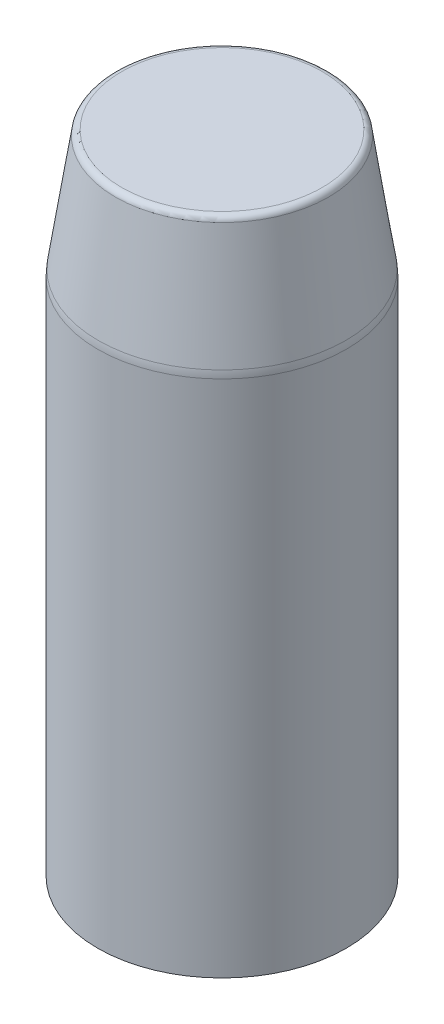
ISO-10303-21;
HEADER;
FILE_DESCRIPTION(('STEP AP214'),'2;1');
FILE_NAME('part.step','',(''),(''),'','','');
FILE_SCHEMA(('AUTOMOTIVE_DESIGN { 1 0 10303 214 1 1 1 1 }'));
ENDSEC;
DATA;
#1=APPLICATION_CONTEXT('core data for automotive mechanical design processes');
#2=APPLICATION_PROTOCOL_DEFINITION('international standard','automotive_design',2000,#1);
#3=PRODUCT_CONTEXT('',#1,'mechanical');
#4=PRODUCT('Part','Part','',(#3));
#5=PRODUCT_RELATED_PRODUCT_CATEGORY('part','',(#4));
#6=PRODUCT_DEFINITION_FORMATION('','',#4);
#7=PRODUCT_DEFINITION_CONTEXT('part definition',#1,'design');
#8=PRODUCT_DEFINITION('design','',#6,#7);
#9=PRODUCT_DEFINITION_SHAPE('','',#8);
#10=(LENGTH_UNIT() NAMED_UNIT(*) SI_UNIT(.MILLI.,.METRE.));
#11=(NAMED_UNIT(*) PLANE_ANGLE_UNIT() SI_UNIT($,.RADIAN.));
#12=(NAMED_UNIT(*) SI_UNIT($,.STERADIAN.) SOLID_ANGLE_UNIT());
#13=UNCERTAINTY_MEASURE_WITH_UNIT(LENGTH_MEASURE(1.E-05),#10,'distance_accuracy_value','');
#14=(GEOMETRIC_REPRESENTATION_CONTEXT(3) GLOBAL_UNCERTAINTY_ASSIGNED_CONTEXT((#13)) GLOBAL_UNIT_ASSIGNED_CONTEXT((#10,
#11,#12)) REPRESENTATION_CONTEXT('',''));
#15=CARTESIAN_POINT('',(0.,0.,0.));
#16=DIRECTION('',(0.,0.,1.));
#17=DIRECTION('',(1.,0.,0.));
#18=AXIS2_PLACEMENT_3D('',#15,#16,#17);
#19=CARTESIAN_POINT('',(5.001,-67.,5.00099999999999));
#20=DIRECTION('',(0.,-1.,0.));
#21=DIRECTION('',(-1.,0.,0.));
#22=AXIS2_PLACEMENT_3D('',#19,#20,#21);
#23=PLANE('',#22);
#24=CARTESIAN_POINT('',(0.,-67.,0.));
#25=DIRECTION('',(0.,-1.,0.));
#26=DIRECTION('',(0.,0.,-1.));
#27=AXIS2_PLACEMENT_3D('',#24,#25,#26);
#28=CIRCLE('',#27,5.);
#29=CARTESIAN_POINT('',(0.,-67.,-5.00000000000002));
#30=VERTEX_POINT('',#29);
#31=EDGE_CURVE('E35',#30,#30,#28,.F.);
#32=ORIENTED_EDGE('',*,*,#31,.F.);
#33=EDGE_LOOP('',(#32));
#34=FACE_BOUND('',#33,.T.);
#35=ADVANCED_FACE('F15',(#34),#23,.T.);
#36=CARTESIAN_POINT('',(0.,-67.,0.));
#37=DIRECTION('',(0.,1.,0.));
#38=DIRECTION('',(0.,0.,1.));
#39=AXIS2_PLACEMENT_3D('',#36,#37,#38);
#40=CYLINDRICAL_SURFACE('',#39,5.);
#41=CARTESIAN_POINT('',(0.,-46.1491656107711,0.));
#42=DIRECTION('',(0.,1.,0.));
#43=DIRECTION('',(-1.,0.,0.));
#44=AXIS2_PLACEMENT_3D('',#41,#42,#43);
#45=CIRCLE('',#44,5.);
#46=CARTESIAN_POINT('',(-5.,-46.1491656107711,0.));
#47=VERTEX_POINT('',#46);
#48=EDGE_CURVE('E31',#47,#47,#45,.T.);
#49=ORIENTED_EDGE('',*,*,#48,.F.);
#50=EDGE_LOOP('',(#49));
#51=FACE_BOUND('',#50,.T.);
#52=ORIENTED_EDGE('',*,*,#31,.T.);
#53=EDGE_LOOP('',(#52));
#54=FACE_BOUND('',#53,.T.);
#55=ADVANCED_FACE('F39',(#51,#54),#40,.T.);
#56=CARTESIAN_POINT('',(0.,-46.1491656107711,0.));
#57=DIRECTION('',(0.,1.,0.));
#58=DIRECTION('',(0.,0.,1.));
#59=AXIS2_PLACEMENT_3D('',#56,#57,#58);
#60=TOROIDAL_SURFACE('',#59,2.99999999999863,2.00000000000137);
#61=ORIENTED_EDGE('',*,*,#48,.T.);
#62=EDGE_LOOP('',(#61));
#63=FACE_BOUND('',#62,.T.);
#64=CARTESIAN_POINT('',(0.,-45.8524847049106,0.));
#65=DIRECTION('',(0.,1.,0.));
#66=DIRECTION('',(-1.,0.,0.));
#67=AXIS2_PLACEMENT_3D('',#64,#65,#66);
#68=CIRCLE('',#67,4.97787270573659);
#69=CARTESIAN_POINT('',(-4.9778727057366,-45.8524847049106,0.));
#70=VERTEX_POINT('',#69);
#71=EDGE_CURVE('E26',#70,#70,#68,.T.);
#72=ORIENTED_EDGE('',*,*,#71,.F.);
#73=EDGE_LOOP('',(#72));
#74=FACE_BOUND('',#73,.T.);
#75=ADVANCED_FACE('F47',(#63,#74),#60,.T.);
#76=CARTESIAN_POINT('',(0.,-41.2129148867674,0.));
#77=DIRECTION('',(0.,-1.,0.));
#78=DIRECTION('',(0.,0.,-1.));
#79=AXIS2_PLACEMENT_3D('',#76,#77,#78);
#80=CONICAL_SURFACE('',#79,4.28193723301512,0.148889947609498);
#81=ORIENTED_EDGE('',*,*,#71,.T.);
#82=EDGE_LOOP('',(#81));
#83=FACE_BOUND('',#82,.T.);
#84=CARTESIAN_POINT('',(0.,-41.2129148867674,0.));
#85=DIRECTION('',(0.,1.,0.));
#86=DIRECTION('',(1.,0.,0.));
#87=AXIS2_PLACEMENT_3D('',#84,#85,#86);
#88=CIRCLE('',#87,4.28193723301512);
#89=CARTESIAN_POINT('',(4.28193723301511,-41.2129148867674,0.));
#90=VERTEX_POINT('',#89);
#91=EDGE_CURVE('E22',#90,#90,#88,.T.);
#92=ORIENTED_EDGE('',*,*,#91,.F.);
#93=EDGE_LOOP('',(#92));
#94=FACE_BOUND('',#93,.T.);
#95=ADVANCED_FACE('F55',(#83,#94),#80,.T.);
#96=CARTESIAN_POINT('',(-4.03570314479805,-41.,4.03570314479803));
#97=DIRECTION('',(0.,1.,0.));
#98=DIRECTION('',(1.,0.,0.));
#99=AXIS2_PLACEMENT_3D('',#96,#97,#98);
#100=PLANE('',#99);
#101=CARTESIAN_POINT('',(0.,-41.,0.));
#102=DIRECTION('',(0.,-1.,0.));
#103=DIRECTION('',(0.,0.,-1.));
#104=AXIS2_PLACEMENT_3D('',#101,#102,#103);
#105=CIRCLE('',#104,4.03470314479804);
#106=CARTESIAN_POINT('',(0.,-41.,-4.03470314479805));
#107=VERTEX_POINT('',#106);
#108=EDGE_CURVE('E10',#107,#107,#105,.T.);
#109=ORIENTED_EDGE('',*,*,#108,.F.);
#110=EDGE_LOOP('',(#109));
#111=FACE_BOUND('',#110,.T.);
#112=ADVANCED_FACE('F51',(#111),#100,.T.);
#113=CARTESIAN_POINT('',(0.,-41.25,0.));
#114=DIRECTION('',(0.,-1.,0.));
#115=DIRECTION('',(0.,0.,-1.));
#116=AXIS2_PLACEMENT_3D('',#113,#114,#115);
#117=TOROIDAL_SURFACE('',#116,4.03470314479804,0.249999999999976);
#118=ORIENTED_EDGE('',*,*,#108,.T.);
#119=EDGE_LOOP('',(#118));
#120=FACE_BOUND('',#119,.T.);
#121=ORIENTED_EDGE('',*,*,#91,.T.);
#122=EDGE_LOOP('',(#121));
#123=FACE_BOUND('',#122,.T.);
#124=ADVANCED_FACE('F17',(#120,#123),#117,.T.);
#125=CLOSED_SHELL('',(#35,#55,#75,#95,#112,#124));
#126=MANIFOLD_SOLID_BREP('B1',#125);
#127=ADVANCED_BREP_SHAPE_REPRESENTATION('',(#18,#126),#14);
#128=SHAPE_DEFINITION_REPRESENTATION(#9,#127);
ENDSEC;
END-ISO-10303-21;
